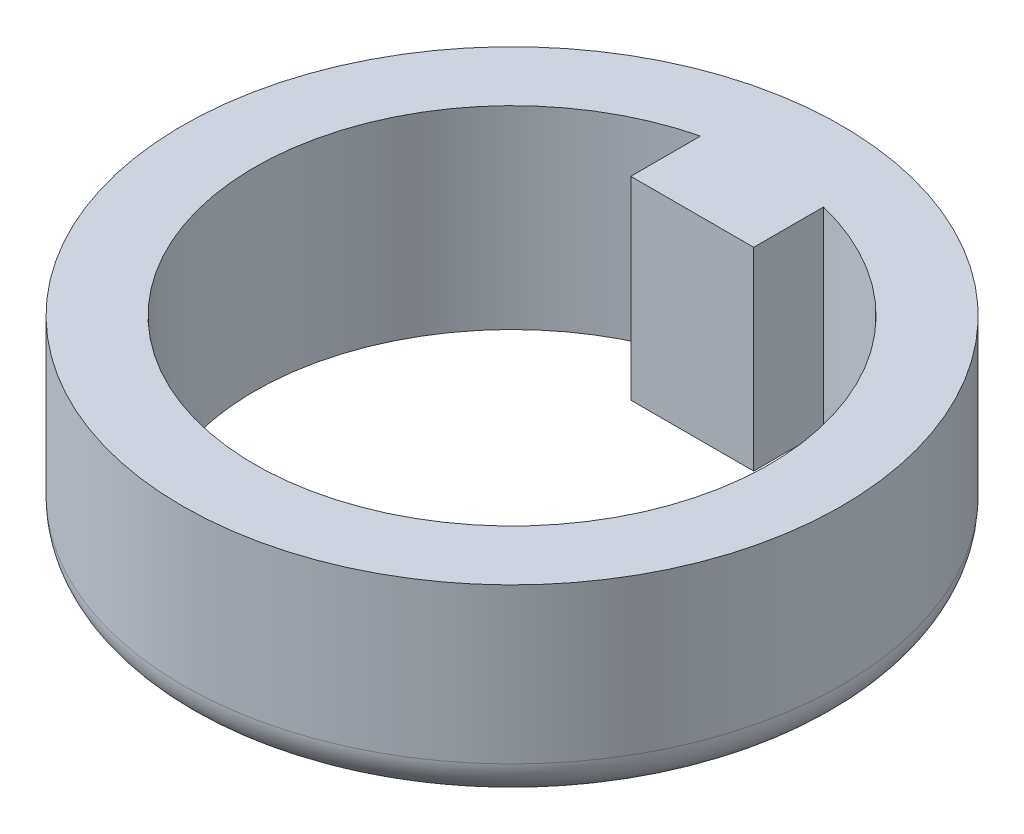
ISO-10303-21;
HEADER;
FILE_DESCRIPTION(('STEP AP214'),'2;1');
FILE_NAME('part.step','',(''),(''),'','','');
FILE_SCHEMA(('AUTOMOTIVE_DESIGN { 1 0 10303 214 1 1 1 1 }'));
ENDSEC;
DATA;
#1=APPLICATION_CONTEXT('core data for automotive mechanical design processes');
#2=APPLICATION_PROTOCOL_DEFINITION('international standard','automotive_design',2000,#1);
#3=PRODUCT_CONTEXT('',#1,'mechanical');
#4=PRODUCT('Part','Part','',(#3));
#5=PRODUCT_RELATED_PRODUCT_CATEGORY('part','',(#4));
#6=PRODUCT_DEFINITION_FORMATION('','',#4);
#7=PRODUCT_DEFINITION_CONTEXT('part definition',#1,'design');
#8=PRODUCT_DEFINITION('design','',#6,#7);
#9=PRODUCT_DEFINITION_SHAPE('','',#8);
#10=(LENGTH_UNIT() NAMED_UNIT(*) SI_UNIT(.MILLI.,.METRE.));
#11=(NAMED_UNIT(*) PLANE_ANGLE_UNIT() SI_UNIT($,.RADIAN.));
#12=(NAMED_UNIT(*) SI_UNIT($,.STERADIAN.) SOLID_ANGLE_UNIT());
#13=UNCERTAINTY_MEASURE_WITH_UNIT(LENGTH_MEASURE(1.E-05),#10,'distance_accuracy_value','');
#14=(GEOMETRIC_REPRESENTATION_CONTEXT(3) GLOBAL_UNCERTAINTY_ASSIGNED_CONTEXT((#13)) GLOBAL_UNIT_ASSIGNED_CONTEXT((#10,
#11,#12)) REPRESENTATION_CONTEXT('',''));
#15=CARTESIAN_POINT('',(0.,0.,0.));
#16=DIRECTION('',(0.,0.,1.));
#17=DIRECTION('',(1.,0.,0.));
#18=AXIS2_PLACEMENT_3D('',#15,#16,#17);
#19=CARTESIAN_POINT('',(0.,5.,0.));
#20=DIRECTION('',(0.,1.,0.));
#21=DIRECTION('',(0.,0.,1.));
#22=AXIS2_PLACEMENT_3D('',#19,#20,#21);
#23=PLANE('',#22);
#24=CARTESIAN_POINT('',(0.,5.,0.));
#25=DIRECTION('',(0.,1.,0.));
#26=DIRECTION('',(0.,0.,1.));
#27=AXIS2_PLACEMENT_3D('',#24,#25,#26);
#28=CIRCLE('',#27,8.5);
#29=CARTESIAN_POINT('',(0.,5.,8.5));
#30=VERTEX_POINT('',#29);
#31=EDGE_CURVE('E90',#30,#30,#28,.T.);
#32=ORIENTED_EDGE('',*,*,#31,.T.);
#33=EDGE_LOOP('',(#32));
#34=FACE_BOUND('',#33,.T.);
#35=DIRECTION('',(0.,0.,1.));
#36=VECTOR('',#35,1.);
#37=CARTESIAN_POINT('',(1.585,5.,-4.64702225837634));
#38=LINE('',#37,#36);
#39=CARTESIAN_POINT('',(1.585,5.,-6.44702225837634));
#40=VERTEX_POINT('',#39);
#41=CARTESIAN_POINT('',(1.585,5.,-4.64702225837634));
#42=VERTEX_POINT('',#41);
#43=EDGE_CURVE('E82',#40,#42,#38,.T.);
#44=ORIENTED_EDGE('',*,*,#43,.F.);
#45=CARTESIAN_POINT('',(0.,5.,0.));
#46=DIRECTION('',(0.,1.,0.));
#47=DIRECTION('',(0.,0.,1.));
#48=AXIS2_PLACEMENT_3D('',#45,#46,#47);
#49=CIRCLE('',#48,6.639);
#50=CARTESIAN_POINT('',(-1.585,5.,-6.44702225837634));
#51=VERTEX_POINT('',#50);
#52=EDGE_CURVE('E74',#51,#40,#49,.T.);
#53=ORIENTED_EDGE('',*,*,#52,.F.);
#54=DIRECTION('',(0.,0.,-1.));
#55=VECTOR('',#54,1.);
#56=CARTESIAN_POINT('',(-1.585,5.,-6.44702225837634));
#57=LINE('',#56,#55);
#58=CARTESIAN_POINT('',(-1.585,5.,-4.64702225837634));
#59=VERTEX_POINT('',#58);
#60=EDGE_CURVE('E96',#59,#51,#57,.T.);
#61=ORIENTED_EDGE('',*,*,#60,.F.);
#62=DIRECTION('',(-1.,0.,0.));
#63=VECTOR('',#62,1.);
#64=CARTESIAN_POINT('',(-1.585,5.,-4.64702225837634));
#65=LINE('',#64,#63);
#66=EDGE_CURVE('E94',#42,#59,#65,.T.);
#67=ORIENTED_EDGE('',*,*,#66,.F.);
#68=EDGE_LOOP('',(#44,#53,#61,#67));
#69=FACE_BOUND('',#68,.T.);
#70=ADVANCED_FACE('F33',(#34,#69),#23,.T.);
#71=CARTESIAN_POINT('',(0.,0.,0.));
#72=DIRECTION('',(0.,1.,0.));
#73=DIRECTION('',(0.,0.,1.));
#74=AXIS2_PLACEMENT_3D('',#71,#72,#73);
#75=PLANE('',#74);
#76=CARTESIAN_POINT('',(0.,0.,0.));
#77=DIRECTION('',(0.,1.,0.));
#78=DIRECTION('',(0.,0.,1.));
#79=AXIS2_PLACEMENT_3D('',#76,#77,#78);
#80=CIRCLE('',#79,7.5);
#81=CARTESIAN_POINT('',(0.,0.,7.5));
#82=VERTEX_POINT('',#81);
#83=EDGE_CURVE('E11',#82,#82,#80,.F.);
#84=ORIENTED_EDGE('',*,*,#83,.T.);
#85=EDGE_LOOP('',(#84));
#86=FACE_BOUND('',#85,.T.);
#87=CARTESIAN_POINT('',(0.,0.,0.));
#88=DIRECTION('',(0.,1.,0.));
#89=DIRECTION('',(0.,0.,1.));
#90=AXIS2_PLACEMENT_3D('',#87,#88,#89);
#91=CIRCLE('',#90,6.639);
#92=CARTESIAN_POINT('',(-1.585,0.,-6.44702225837634));
#93=VERTEX_POINT('',#92);
#94=CARTESIAN_POINT('',(1.585,0.,-6.44702225837634));
#95=VERTEX_POINT('',#94);
#96=EDGE_CURVE('E56',#93,#95,#91,.T.);
#97=ORIENTED_EDGE('',*,*,#96,.T.);
#98=DIRECTION('',(0.,0.,1.));
#99=VECTOR('',#98,1.);
#100=CARTESIAN_POINT('',(1.585,0.,-4.64702225837634));
#101=LINE('',#100,#99);
#102=CARTESIAN_POINT('',(1.585,0.,-4.64702225837634));
#103=VERTEX_POINT('',#102);
#104=EDGE_CURVE('E89',#95,#103,#101,.T.);
#105=ORIENTED_EDGE('',*,*,#104,.T.);
#106=DIRECTION('',(-1.,0.,0.));
#107=VECTOR('',#106,1.);
#108=CARTESIAN_POINT('',(-1.585,0.,-4.64702225837634));
#109=LINE('',#108,#107);
#110=CARTESIAN_POINT('',(-1.585,0.,-4.64702225837634));
#111=VERTEX_POINT('',#110);
#112=EDGE_CURVE('E102',#103,#111,#109,.T.);
#113=ORIENTED_EDGE('',*,*,#112,.T.);
#114=DIRECTION('',(0.,0.,-1.));
#115=VECTOR('',#114,1.);
#116=CARTESIAN_POINT('',(-1.585,0.,-6.44702225837634));
#117=LINE('',#116,#115);
#118=EDGE_CURVE('E83',#111,#93,#117,.T.);
#119=ORIENTED_EDGE('',*,*,#118,.T.);
#120=EDGE_LOOP('',(#97,#105,#113,#119));
#121=FACE_BOUND('',#120,.T.);
#122=ADVANCED_FACE('F127',(#86,#121),#75,.F.);
#123=CARTESIAN_POINT('',(0.,5.,0.));
#124=DIRECTION('',(0.,-1.,0.));
#125=DIRECTION('',(0.,0.,-1.));
#126=AXIS2_PLACEMENT_3D('',#123,#124,#125);
#127=CYLINDRICAL_SURFACE('',#126,8.5);
#128=CARTESIAN_POINT('',(0.,1.,0.));
#129=DIRECTION('',(0.,1.,0.));
#130=DIRECTION('',(0.,0.,1.));
#131=AXIS2_PLACEMENT_3D('',#128,#129,#130);
#132=CIRCLE('',#131,8.5);
#133=CARTESIAN_POINT('',(0.,1.,8.5));
#134=VERTEX_POINT('',#133);
#135=EDGE_CURVE('E41',#134,#134,#132,.T.);
#136=ORIENTED_EDGE('',*,*,#135,.T.);
#137=EDGE_LOOP('',(#136));
#138=FACE_BOUND('',#137,.T.);
#139=ORIENTED_EDGE('',*,*,#31,.F.);
#140=EDGE_LOOP('',(#139));
#141=FACE_BOUND('',#140,.T.);
#142=ADVANCED_FACE('F114',(#138,#141),#127,.T.);
#143=CARTESIAN_POINT('',(0.,5.,0.));
#144=DIRECTION('',(0.,-1.,0.));
#145=DIRECTION('',(0.,0.,-1.));
#146=AXIS2_PLACEMENT_3D('',#143,#144,#145);
#147=CYLINDRICAL_SURFACE('',#146,6.639);
#148=ORIENTED_EDGE('',*,*,#96,.F.);
#149=DIRECTION('',(0.,-1.,0.));
#150=VECTOR('',#149,1.);
#151=CARTESIAN_POINT('',(-1.585,5.,-6.44702225837634));
#152=LINE('',#151,#150);
#153=EDGE_CURVE('E78',#51,#93,#152,.T.);
#154=ORIENTED_EDGE('',*,*,#153,.F.);
#155=ORIENTED_EDGE('',*,*,#52,.T.);
#156=DIRECTION('',(0.,-1.,0.));
#157=VECTOR('',#156,1.);
#158=CARTESIAN_POINT('',(1.585,5.,-6.44702225837634));
#159=LINE('',#158,#157);
#160=EDGE_CURVE('E77',#40,#95,#159,.T.);
#161=ORIENTED_EDGE('',*,*,#160,.T.);
#162=EDGE_LOOP('',(#148,#154,#155,#161));
#163=FACE_BOUND('',#162,.T.);
#164=ADVANCED_FACE('F76',(#163),#147,.F.);
#165=CARTESIAN_POINT('',(1.585,5.,-4.64702225837634));
#166=DIRECTION('',(1.,0.,0.));
#167=DIRECTION('',(0.,0.,-1.));
#168=AXIS2_PLACEMENT_3D('',#165,#166,#167);
#169=PLANE('',#168);
#170=ORIENTED_EDGE('',*,*,#104,.F.);
#171=ORIENTED_EDGE('',*,*,#160,.F.);
#172=ORIENTED_EDGE('',*,*,#43,.T.);
#173=DIRECTION('',(0.,-1.,0.));
#174=VECTOR('',#173,1.);
#175=CARTESIAN_POINT('',(1.585,5.,-4.64702225837634));
#176=LINE('',#175,#174);
#177=EDGE_CURVE('E91',#42,#103,#176,.T.);
#178=ORIENTED_EDGE('',*,*,#177,.T.);
#179=EDGE_LOOP('',(#170,#171,#172,#178));
#180=FACE_BOUND('',#179,.T.);
#181=ADVANCED_FACE('F86',(#180),#169,.T.);
#182=CARTESIAN_POINT('',(-1.585,5.,-4.64702225837634));
#183=DIRECTION('',(0.,0.,1.));
#184=DIRECTION('',(1.,0.,0.));
#185=AXIS2_PLACEMENT_3D('',#182,#183,#184);
#186=PLANE('',#185);
#187=ORIENTED_EDGE('',*,*,#112,.F.);
#188=ORIENTED_EDGE('',*,*,#177,.F.);
#189=ORIENTED_EDGE('',*,*,#66,.T.);
#190=DIRECTION('',(0.,-1.,0.));
#191=VECTOR('',#190,1.);
#192=CARTESIAN_POINT('',(-1.585,5.,-4.64702225837634));
#193=LINE('',#192,#191);
#194=EDGE_CURVE('E48',#59,#111,#193,.T.);
#195=ORIENTED_EDGE('',*,*,#194,.T.);
#196=EDGE_LOOP('',(#187,#188,#189,#195));
#197=FACE_BOUND('',#196,.T.);
#198=ADVANCED_FACE('F123',(#197),#186,.T.);
#199=CARTESIAN_POINT('',(-1.585,5.,-6.44702225837634));
#200=DIRECTION('',(-1.,0.,0.));
#201=DIRECTION('',(0.,0.,1.));
#202=AXIS2_PLACEMENT_3D('',#199,#200,#201);
#203=PLANE('',#202);
#204=ORIENTED_EDGE('',*,*,#118,.F.);
#205=ORIENTED_EDGE('',*,*,#194,.F.);
#206=ORIENTED_EDGE('',*,*,#60,.T.);
#207=ORIENTED_EDGE('',*,*,#153,.T.);
#208=EDGE_LOOP('',(#204,#205,#206,#207));
#209=FACE_BOUND('',#208,.T.);
#210=ADVANCED_FACE('F118',(#209),#203,.T.);
#211=CARTESIAN_POINT('',(0.,1.,0.));
#212=DIRECTION('',(0.,1.,0.));
#213=DIRECTION('',(0.,0.,1.));
#214=AXIS2_PLACEMENT_3D('',#211,#212,#213);
#215=TOROIDAL_SURFACE('',#214,7.5,1.);
#216=ORIENTED_EDGE('',*,*,#83,.F.);
#217=EDGE_LOOP('',(#216));
#218=FACE_BOUND('',#217,.T.);
#219=ORIENTED_EDGE('',*,*,#135,.F.);
#220=EDGE_LOOP('',(#219));
#221=FACE_BOUND('',#220,.T.);
#222=ADVANCED_FACE('F35',(#218,#221),#215,.T.);
#223=CLOSED_SHELL('',(#70,#122,#142,#164,#181,#198,#210,#222));
#224=MANIFOLD_SOLID_BREP('B2',#223);
#225=ADVANCED_BREP_SHAPE_REPRESENTATION('',(#18,#224),#14);
#226=SHAPE_DEFINITION_REPRESENTATION(#9,#225);
ENDSEC;
END-ISO-10303-21;
